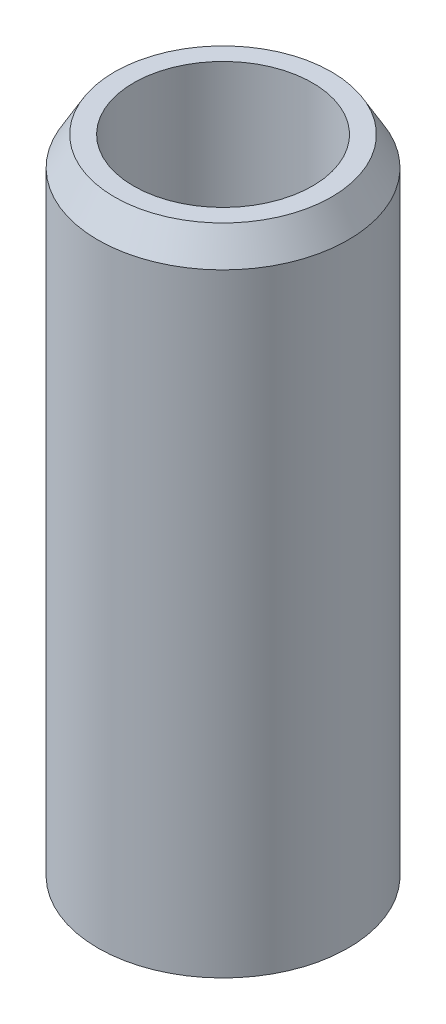
ISO-10303-21;
HEADER;
FILE_DESCRIPTION(('STEP AP214'),'2;1');
FILE_NAME('part.step','',(''),(''),'','','');
FILE_SCHEMA(('AUTOMOTIVE_DESIGN { 1 0 10303 214 1 1 1 1 }'));
ENDSEC;
DATA;
#1=APPLICATION_CONTEXT('core data for automotive mechanical design processes');
#2=APPLICATION_PROTOCOL_DEFINITION('international standard','automotive_design',2000,#1);
#3=PRODUCT_CONTEXT('',#1,'mechanical');
#4=PRODUCT('Part','Part','',(#3));
#5=PRODUCT_RELATED_PRODUCT_CATEGORY('part','',(#4));
#6=PRODUCT_DEFINITION_FORMATION('','',#4);
#7=PRODUCT_DEFINITION_CONTEXT('part definition',#1,'design');
#8=PRODUCT_DEFINITION('design','',#6,#7);
#9=PRODUCT_DEFINITION_SHAPE('','',#8);
#10=(LENGTH_UNIT() NAMED_UNIT(*) SI_UNIT(.MILLI.,.METRE.));
#11=(NAMED_UNIT(*) PLANE_ANGLE_UNIT() SI_UNIT($,.RADIAN.));
#12=(NAMED_UNIT(*) SI_UNIT($,.STERADIAN.) SOLID_ANGLE_UNIT());
#13=UNCERTAINTY_MEASURE_WITH_UNIT(LENGTH_MEASURE(1.E-05),#10,'distance_accuracy_value','');
#14=(GEOMETRIC_REPRESENTATION_CONTEXT(3) GLOBAL_UNCERTAINTY_ASSIGNED_CONTEXT((#13)) GLOBAL_UNIT_ASSIGNED_CONTEXT((#10,
#11,#12)) REPRESENTATION_CONTEXT('',''));
#15=CARTESIAN_POINT('',(0.,0.,0.));
#16=DIRECTION('',(0.,0.,1.));
#17=DIRECTION('',(1.,0.,0.));
#18=AXIS2_PLACEMENT_3D('',#15,#16,#17);
#19=CARTESIAN_POINT('',(0.,131.607697525774,0.));
#20=DIRECTION('',(0.,-1.,0.));
#21=DIRECTION('',(0.,0.,-1.));
#22=AXIS2_PLACEMENT_3D('',#19,#20,#21);
#23=CYLINDRICAL_SURFACE('',#22,25.);
#24=CARTESIAN_POINT('',(0.,125.843770319713,0.));
#25=DIRECTION('',(0.,1.,0.));
#26=DIRECTION('',(0.,0.,1.));
#27=AXIS2_PLACEMENT_3D('',#24,#25,#26);
#28=CIRCLE('',#27,25.);
#29=CARTESIAN_POINT('',(0.,125.843770319713,25.));
#30=VERTEX_POINT('',#29);
#31=EDGE_CURVE('E50',#30,#30,#28,.F.);
#32=ORIENTED_EDGE('',*,*,#31,.T.);
#33=EDGE_LOOP('',(#32));
#34=FACE_BOUND('',#33,.T.);
#35=CARTESIAN_POINT('',(0.,3.327804924009,0.));
#36=DIRECTION('',(0.,1.,0.));
#37=DIRECTION('',(0.,0.,1.));
#38=AXIS2_PLACEMENT_3D('',#35,#36,#37);
#39=CIRCLE('',#38,25.);
#40=CARTESIAN_POINT('',(0.,3.327804924009,25.));
#41=VERTEX_POINT('',#40);
#42=EDGE_CURVE('E51',#41,#41,#39,.T.);
#43=ORIENTED_EDGE('',*,*,#42,.T.);
#44=EDGE_LOOP('',(#43));
#45=FACE_BOUND('',#44,.T.);
#46=ADVANCED_FACE('F39',(#34,#45),#23,.T.);
#47=CARTESIAN_POINT('',(0.,131.607697525774,0.));
#48=DIRECTION('',(0.,1.,0.));
#49=DIRECTION('',(0.,0.,1.));
#50=AXIS2_PLACEMENT_3D('',#47,#48,#49);
#51=PLANE('',#50);
#52=CARTESIAN_POINT('',(0.,131.607697525774,0.));
#53=DIRECTION('',(0.,1.,0.));
#54=DIRECTION('',(0.,0.,1.));
#55=AXIS2_PLACEMENT_3D('',#52,#53,#54);
#56=CIRCLE('',#55,21.6721950759911);
#57=CARTESIAN_POINT('',(0.,131.607697525774,21.6721950759911));
#58=VERTEX_POINT('',#57);
#59=EDGE_CURVE('E54',#58,#58,#56,.T.);
#60=ORIENTED_EDGE('',*,*,#59,.T.);
#61=EDGE_LOOP('',(#60));
#62=FACE_BOUND('',#61,.T.);
#63=CARTESIAN_POINT('',(0.,131.607697525774,0.));
#64=DIRECTION('',(0.,1.,0.));
#65=DIRECTION('',(0.,0.,1.));
#66=AXIS2_PLACEMENT_3D('',#63,#64,#65);
#67=CIRCLE('',#66,17.8701213827518);
#68=CARTESIAN_POINT('',(0.,131.607697525774,17.8701213827518));
#69=VERTEX_POINT('',#68);
#70=EDGE_CURVE('E58',#69,#69,#67,.T.);
#71=ORIENTED_EDGE('',*,*,#70,.F.);
#72=EDGE_LOOP('',(#71));
#73=FACE_BOUND('',#72,.T.);
#74=ADVANCED_FACE('F69',(#62,#73),#51,.T.);
#75=CARTESIAN_POINT('',(0.,0.,0.));
#76=DIRECTION('',(0.,1.,0.));
#77=DIRECTION('',(0.,0.,1.));
#78=AXIS2_PLACEMENT_3D('',#75,#76,#77);
#79=PLANE('',#78);
#80=CARTESIAN_POINT('',(0.,0.,0.));
#81=DIRECTION('',(0.,1.,0.));
#82=DIRECTION('',(0.,0.,1.));
#83=AXIS2_PLACEMENT_3D('',#80,#81,#82);
#84=CIRCLE('',#83,19.2360727939385);
#85=CARTESIAN_POINT('',(0.,0.,19.2360727939385));
#86=VERTEX_POINT('',#85);
#87=EDGE_CURVE('E10',#86,#86,#84,.F.);
#88=ORIENTED_EDGE('',*,*,#87,.T.);
#89=EDGE_LOOP('',(#88));
#90=FACE_BOUND('',#89,.T.);
#91=CARTESIAN_POINT('',(0.,0.,0.));
#92=DIRECTION('',(0.,1.,0.));
#93=DIRECTION('',(0.,0.,1.));
#94=AXIS2_PLACEMENT_3D('',#91,#92,#93);
#95=CIRCLE('',#94,17.8701213827518);
#96=CARTESIAN_POINT('',(0.,0.,17.8701213827518));
#97=VERTEX_POINT('',#96);
#98=EDGE_CURVE('E63',#97,#97,#95,.T.);
#99=ORIENTED_EDGE('',*,*,#98,.T.);
#100=EDGE_LOOP('',(#99));
#101=FACE_BOUND('',#100,.T.);
#102=ADVANCED_FACE('F75',(#90,#101),#79,.F.);
#103=CARTESIAN_POINT('',(0.,131.607697525774,0.));
#104=DIRECTION('',(0.,-1.,0.));
#105=DIRECTION('',(0.,0.,-1.));
#106=AXIS2_PLACEMENT_3D('',#103,#104,#105);
#107=CYLINDRICAL_SURFACE('',#106,17.8701213827518);
#108=ORIENTED_EDGE('',*,*,#70,.T.);
#109=EDGE_LOOP('',(#108));
#110=FACE_BOUND('',#109,.T.);
#111=ORIENTED_EDGE('',*,*,#98,.F.);
#112=EDGE_LOOP('',(#111));
#113=FACE_BOUND('',#112,.T.);
#114=ADVANCED_FACE('F70',(#110,#113),#107,.F.);
#115=CARTESIAN_POINT('',(0.,131.607697525774,0.));
#116=DIRECTION('',(0.,-1.,0.));
#117=DIRECTION('',(0.,0.,-1.));
#118=AXIS2_PLACEMENT_3D('',#115,#116,#117);
#119=CONICAL_SURFACE('',#118,21.6721950759911,0.523598775598292);
#120=ORIENTED_EDGE('',*,*,#31,.F.);
#121=EDGE_LOOP('',(#120));
#122=FACE_BOUND('',#121,.T.);
#123=ORIENTED_EDGE('',*,*,#59,.F.);
#124=EDGE_LOOP('',(#123));
#125=FACE_BOUND('',#124,.T.);
#126=ADVANCED_FACE('F81',(#122,#125),#119,.T.);
#127=CARTESIAN_POINT('',(0.,3.327804924009,0.));
#128=DIRECTION('',(0.,1.,0.));
#129=DIRECTION('',(0.,0.,1.));
#130=AXIS2_PLACEMENT_3D('',#127,#128,#129);
#131=CONICAL_SURFACE('',#130,25.,1.0471975511966);
#132=ORIENTED_EDGE('',*,*,#87,.F.);
#133=EDGE_LOOP('',(#132));
#134=FACE_BOUND('',#133,.T.);
#135=ORIENTED_EDGE('',*,*,#42,.F.);
#136=EDGE_LOOP('',(#135));
#137=FACE_BOUND('',#136,.T.);
#138=ADVANCED_FACE('F45',(#134,#137),#131,.T.);
#139=CLOSED_SHELL('',(#46,#74,#102,#114,#126,#138));
#140=MANIFOLD_SOLID_BREP('B2',#139);
#141=ADVANCED_BREP_SHAPE_REPRESENTATION('',(#18,#140),#14);
#142=SHAPE_DEFINITION_REPRESENTATION(#9,#141);
ENDSEC;
END-ISO-10303-21;
